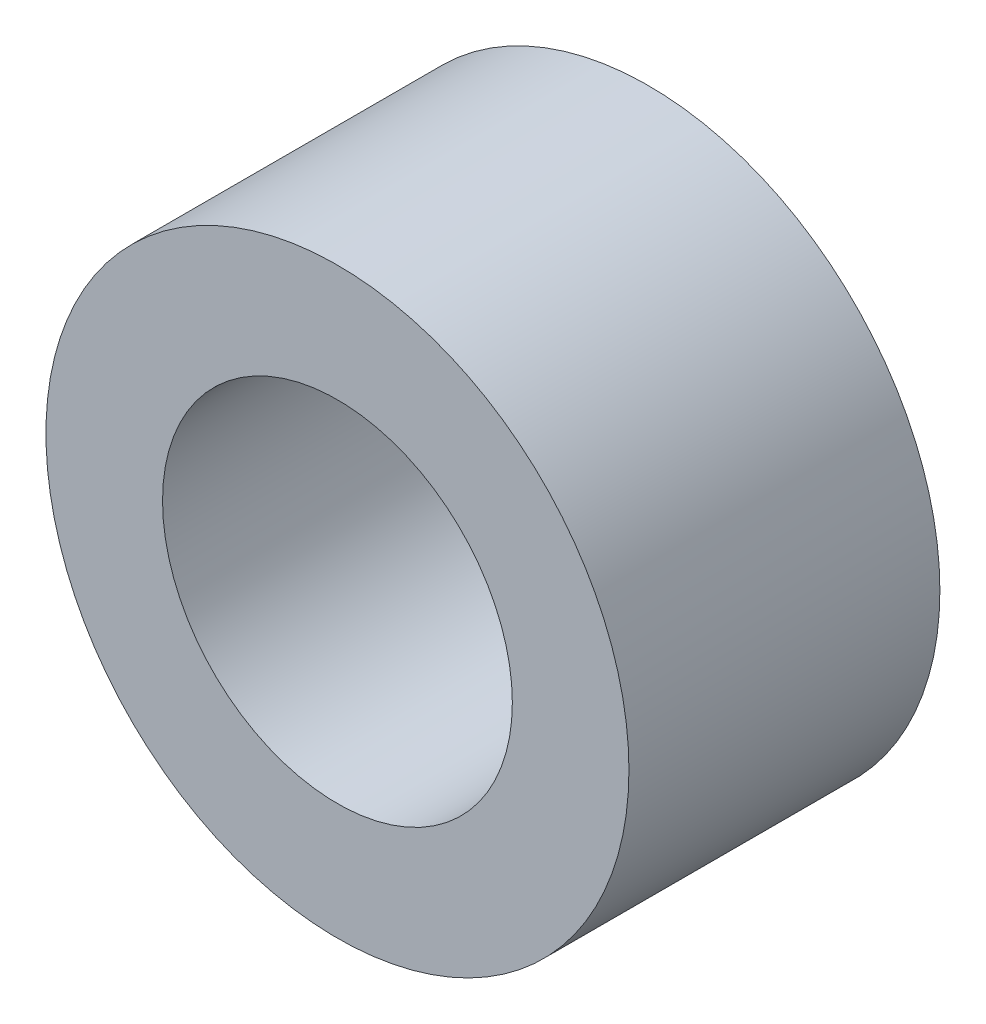
ISO-10303-21;
HEADER;
FILE_DESCRIPTION(('STEP AP214'),'2;1');
FILE_NAME('part.step','',(''),(''),'','','');
FILE_SCHEMA(('AUTOMOTIVE_DESIGN { 1 0 10303 214 1 1 1 1 }'));
ENDSEC;
DATA;
#1=APPLICATION_CONTEXT('core data for automotive mechanical design processes');
#2=APPLICATION_PROTOCOL_DEFINITION('international standard','automotive_design',2000,#1);
#3=PRODUCT_CONTEXT('',#1,'mechanical');
#4=PRODUCT('Part','Part','',(#3));
#5=PRODUCT_RELATED_PRODUCT_CATEGORY('part','',(#4));
#6=PRODUCT_DEFINITION_FORMATION('','',#4);
#7=PRODUCT_DEFINITION_CONTEXT('part definition',#1,'design');
#8=PRODUCT_DEFINITION('design','',#6,#7);
#9=PRODUCT_DEFINITION_SHAPE('','',#8);
#10=(LENGTH_UNIT() NAMED_UNIT(*) SI_UNIT(.MILLI.,.METRE.));
#11=(NAMED_UNIT(*) PLANE_ANGLE_UNIT() SI_UNIT($,.RADIAN.));
#12=(NAMED_UNIT(*) SI_UNIT($,.STERADIAN.) SOLID_ANGLE_UNIT());
#13=UNCERTAINTY_MEASURE_WITH_UNIT(LENGTH_MEASURE(1.E-05),#10,'distance_accuracy_value','');
#14=(GEOMETRIC_REPRESENTATION_CONTEXT(3) GLOBAL_UNCERTAINTY_ASSIGNED_CONTEXT((#13)) GLOBAL_UNIT_ASSIGNED_CONTEXT((#10,
#11,#12)) REPRESENTATION_CONTEXT('',''));
#15=CARTESIAN_POINT('',(0.,0.,0.));
#16=DIRECTION('',(0.,0.,1.));
#17=DIRECTION('',(1.,0.,0.));
#18=AXIS2_PLACEMENT_3D('',#15,#16,#17);
#19=CARTESIAN_POINT('',(0.,0.,4.));
#20=DIRECTION('',(0.,0.,1.));
#21=DIRECTION('',(1.,0.,0.));
#22=AXIS2_PLACEMENT_3D('',#19,#20,#21);
#23=PLANE('',#22);
#24=CARTESIAN_POINT('',(0.,0.,4.));
#25=DIRECTION('',(0.,0.,1.));
#26=DIRECTION('',(1.,0.,0.));
#27=AXIS2_PLACEMENT_3D('',#24,#25,#26);
#28=CIRCLE('',#27,3.75);
#29=CARTESIAN_POINT('',(3.75,0.,4.));
#30=VERTEX_POINT('',#29);
#31=EDGE_CURVE('E10',#30,#30,#28,.T.);
#32=ORIENTED_EDGE('',*,*,#31,.T.);
#33=EDGE_LOOP('',(#32));
#34=FACE_BOUND('',#33,.T.);
#35=CARTESIAN_POINT('',(0.,0.,4.));
#36=DIRECTION('',(0.,0.,1.));
#37=DIRECTION('',(1.,0.,0.));
#38=AXIS2_PLACEMENT_3D('',#35,#36,#37);
#39=CIRCLE('',#38,2.25);
#40=CARTESIAN_POINT('',(2.25,0.,4.));
#41=VERTEX_POINT('',#40);
#42=EDGE_CURVE('E56',#41,#41,#39,.T.);
#43=ORIENTED_EDGE('',*,*,#42,.F.);
#44=EDGE_LOOP('',(#43));
#45=FACE_BOUND('',#44,.T.);
#46=ADVANCED_FACE('F43',(#34,#45),#23,.T.);
#47=CARTESIAN_POINT('',(0.,0.,0.));
#48=DIRECTION('',(0.,0.,1.));
#49=DIRECTION('',(1.,0.,0.));
#50=AXIS2_PLACEMENT_3D('',#47,#48,#49);
#51=PLANE('',#50);
#52=CARTESIAN_POINT('',(0.,0.,0.));
#53=DIRECTION('',(0.,0.,1.));
#54=DIRECTION('',(1.,0.,0.));
#55=AXIS2_PLACEMENT_3D('',#52,#53,#54);
#56=CIRCLE('',#55,3.75);
#57=CARTESIAN_POINT('',(3.75,0.,0.));
#58=VERTEX_POINT('',#57);
#59=EDGE_CURVE('E47',#58,#58,#56,.T.);
#60=ORIENTED_EDGE('',*,*,#59,.F.);
#61=EDGE_LOOP('',(#60));
#62=FACE_BOUND('',#61,.T.);
#63=CARTESIAN_POINT('',(0.,0.,0.));
#64=DIRECTION('',(0.,0.,1.));
#65=DIRECTION('',(1.,0.,0.));
#66=AXIS2_PLACEMENT_3D('',#63,#64,#65);
#67=CIRCLE('',#66,2.25);
#68=CARTESIAN_POINT('',(2.25,0.,0.));
#69=VERTEX_POINT('',#68);
#70=EDGE_CURVE('E58',#69,#69,#67,.T.);
#71=ORIENTED_EDGE('',*,*,#70,.T.);
#72=EDGE_LOOP('',(#71));
#73=FACE_BOUND('',#72,.T.);
#74=ADVANCED_FACE('F70',(#62,#73),#51,.F.);
#75=CARTESIAN_POINT('',(0.,0.,4.));
#76=DIRECTION('',(0.,0.,-1.));
#77=DIRECTION('',(-1.,0.,0.));
#78=AXIS2_PLACEMENT_3D('',#75,#76,#77);
#79=CYLINDRICAL_SURFACE('',#78,3.75);
#80=ORIENTED_EDGE('',*,*,#31,.F.);
#81=EDGE_LOOP('',(#80));
#82=FACE_BOUND('',#81,.T.);
#83=ORIENTED_EDGE('',*,*,#59,.T.);
#84=EDGE_LOOP('',(#83));
#85=FACE_BOUND('',#84,.T.);
#86=ADVANCED_FACE('F45',(#82,#85),#79,.T.);
#87=CARTESIAN_POINT('',(0.,0.,4.));
#88=DIRECTION('',(0.,0.,-1.));
#89=DIRECTION('',(-1.,0.,0.));
#90=AXIS2_PLACEMENT_3D('',#87,#88,#89);
#91=CYLINDRICAL_SURFACE('',#90,2.25);
#92=ORIENTED_EDGE('',*,*,#42,.T.);
#93=EDGE_LOOP('',(#92));
#94=FACE_BOUND('',#93,.T.);
#95=ORIENTED_EDGE('',*,*,#70,.F.);
#96=EDGE_LOOP('',(#95));
#97=FACE_BOUND('',#96,.T.);
#98=ADVANCED_FACE('F66',(#94,#97),#91,.F.);
#99=CLOSED_SHELL('',(#46,#74,#86,#98));
#100=MANIFOLD_SOLID_BREP('B2',#99);
#101=ADVANCED_BREP_SHAPE_REPRESENTATION('',(#18,#100),#14);
#102=SHAPE_DEFINITION_REPRESENTATION(#9,#101);
ENDSEC;
END-ISO-10303-21;
